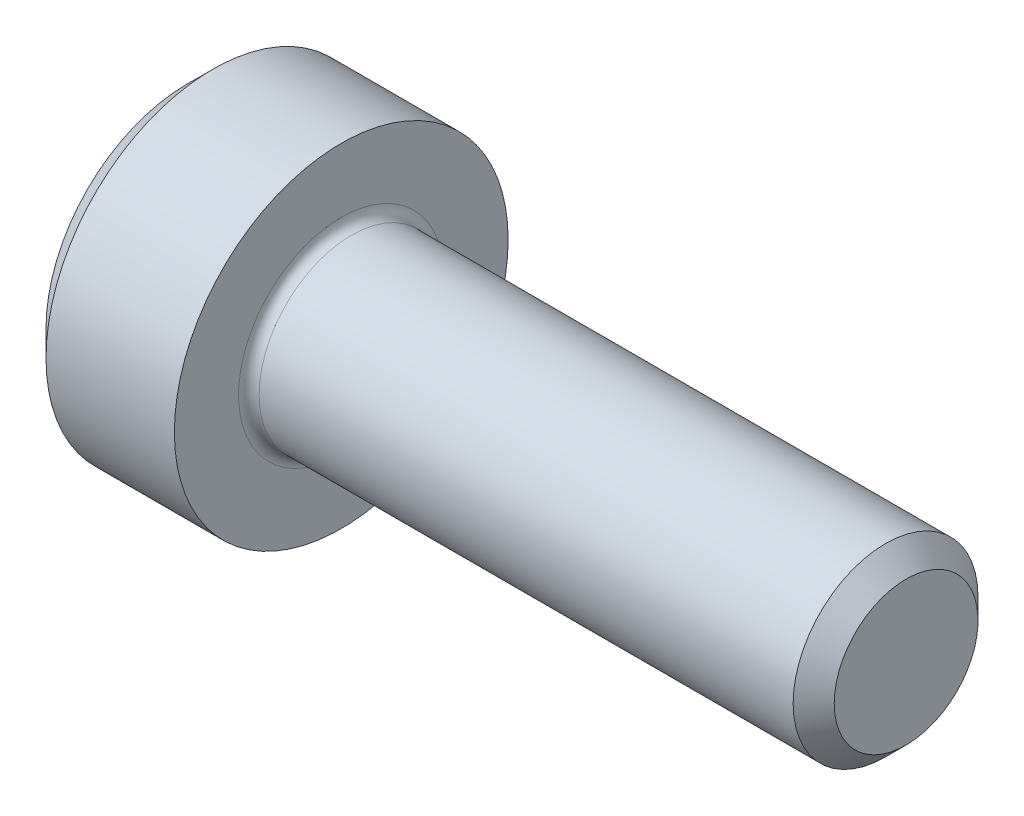
ISO-10303-21;
HEADER;
FILE_DESCRIPTION(('STEP AP214'),'2;1');
FILE_NAME('part.step','',(''),(''),'','','');
FILE_SCHEMA(('AUTOMOTIVE_DESIGN { 1 0 10303 214 1 1 1 1 }'));
ENDSEC;
DATA;
#1=APPLICATION_CONTEXT('core data for automotive mechanical design processes');
#2=APPLICATION_PROTOCOL_DEFINITION('international standard','automotive_design',2000,#1);
#3=PRODUCT_CONTEXT('',#1,'mechanical');
#4=PRODUCT('Part','Part','',(#3));
#5=PRODUCT_RELATED_PRODUCT_CATEGORY('part','',(#4));
#6=PRODUCT_DEFINITION_FORMATION('','',#4);
#7=PRODUCT_DEFINITION_CONTEXT('part definition',#1,'design');
#8=PRODUCT_DEFINITION('design','',#6,#7);
#9=PRODUCT_DEFINITION_SHAPE('','',#8);
#10=(LENGTH_UNIT() NAMED_UNIT(*) SI_UNIT(.MILLI.,.METRE.));
#11=(NAMED_UNIT(*) PLANE_ANGLE_UNIT() SI_UNIT($,.RADIAN.));
#12=(NAMED_UNIT(*) SI_UNIT($,.STERADIAN.) SOLID_ANGLE_UNIT());
#13=UNCERTAINTY_MEASURE_WITH_UNIT(LENGTH_MEASURE(1.E-05),#10,'distance_accuracy_value','');
#14=(GEOMETRIC_REPRESENTATION_CONTEXT(3) GLOBAL_UNCERTAINTY_ASSIGNED_CONTEXT((#13)) GLOBAL_UNIT_ASSIGNED_CONTEXT((#10,
#11,#12)) REPRESENTATION_CONTEXT('',''));
#15=CARTESIAN_POINT('',(0.,0.,0.));
#16=DIRECTION('',(0.,0.,1.));
#17=DIRECTION('',(1.,0.,0.));
#18=AXIS2_PLACEMENT_3D('',#15,#16,#17);
#19=CARTESIAN_POINT('',(0.,0.,0.));
#20=DIRECTION('',(-1.,0.,0.));
#21=DIRECTION('',(0.,0.,1.));
#22=AXIS2_PLACEMENT_3D('',#19,#20,#21);
#23=PLANE('',#22);
#24=DIRECTION('',(0.,-0.5,0.866025403784439));
#25=VECTOR('',#24,1.);
#26=CARTESIAN_POINT('',(0.,1.8475208614068,0.));
#27=LINE('',#26,#25);
#28=CARTESIAN_POINT('',(0.,1.8475208614068,0.));
#29=VERTEX_POINT('',#28);
#30=CARTESIAN_POINT('',(0.,0.9237604307034,1.6));
#31=VERTEX_POINT('',#30);
#32=EDGE_CURVE('E393',#29,#31,#27,.T.);
#33=ORIENTED_EDGE('',*,*,#32,.T.);
#34=DIRECTION('',(0.,1.,0.));
#35=VECTOR('',#34,1.);
#36=CARTESIAN_POINT('',(0.,-0.923760430703403,1.6));
#37=LINE('',#36,#35);
#38=CARTESIAN_POINT('',(0.,-0.923760430703403,1.6));
#39=VERTEX_POINT('',#38);
#40=EDGE_CURVE('E135',#39,#31,#37,.T.);
#41=ORIENTED_EDGE('',*,*,#40,.F.);
#42=DIRECTION('',(0.,-0.500000000000001,-0.866025403784438));
#43=VECTOR('',#42,1.);
#44=CARTESIAN_POINT('',(0.,-0.923760430703403,1.6));
#45=LINE('',#44,#43);
#46=CARTESIAN_POINT('',(0.,-1.84752086140681,0.));
#47=VERTEX_POINT('',#46);
#48=EDGE_CURVE('E396',#39,#47,#45,.T.);
#49=ORIENTED_EDGE('',*,*,#48,.T.);
#50=DIRECTION('',(0.,0.5,-0.866025403784439));
#51=VECTOR('',#50,1.);
#52=CARTESIAN_POINT('',(0.,-1.84752086140681,0.));
#53=LINE('',#52,#51);
#54=CARTESIAN_POINT('',(0.,-0.923760430703406,-1.6));
#55=VERTEX_POINT('',#54);
#56=EDGE_CURVE('E399',#47,#55,#53,.T.);
#57=ORIENTED_EDGE('',*,*,#56,.T.);
#58=DIRECTION('',(0.,-1.,0.));
#59=VECTOR('',#58,1.);
#60=CARTESIAN_POINT('',(0.,0.923760430703397,-1.6));
#61=LINE('',#60,#59);
#62=CARTESIAN_POINT('',(0.,0.923760430703397,-1.6));
#63=VERTEX_POINT('',#62);
#64=EDGE_CURVE('E402',#63,#55,#61,.T.);
#65=ORIENTED_EDGE('',*,*,#64,.F.);
#66=DIRECTION('',(0.,-0.500000000000001,-0.866025403784438));
#67=VECTOR('',#66,1.);
#68=CARTESIAN_POINT('',(0.,1.8475208614068,0.));
#69=LINE('',#68,#67);
#70=EDGE_CURVE('E130',#29,#63,#69,.T.);
#71=ORIENTED_EDGE('',*,*,#70,.F.);
#72=EDGE_LOOP('',(#33,#41,#49,#57,#65,#71));
#73=FACE_BOUND('',#72,.T.);
#74=CARTESIAN_POINT('',(0.,0.,0.));
#75=DIRECTION('',(-1.,0.,0.));
#76=DIRECTION('',(0.,0.,1.));
#77=AXIS2_PLACEMENT_3D('',#74,#75,#76);
#78=CIRCLE('',#77,2.75);
#79=CARTESIAN_POINT('',(0.,0.,2.75));
#80=VERTEX_POINT('',#79);
#81=EDGE_CURVE('E146',#80,#80,#78,.T.);
#82=ORIENTED_EDGE('',*,*,#81,.T.);
#83=EDGE_LOOP('',(#82));
#84=FACE_BOUND('',#83,.T.);
#85=ADVANCED_FACE('F39',(#73,#84),#23,.T.);
#86=CARTESIAN_POINT('',(14.,1.4,0.));
#87=DIRECTION('',(1.,0.,0.));
#88=DIRECTION('',(0.,0.,-1.));
#89=AXIS2_PLACEMENT_3D('',#86,#87,#88);
#90=PLANE('',#89);
#91=CARTESIAN_POINT('',(14.,0.,0.));
#92=DIRECTION('',(-1.,0.,0.));
#93=DIRECTION('',(0.,0.,1.));
#94=AXIS2_PLACEMENT_3D('',#91,#92,#93);
#95=CIRCLE('',#94,1.4);
#96=CARTESIAN_POINT('',(14.,0.,1.4));
#97=VERTEX_POINT('',#96);
#98=EDGE_CURVE('E159',#97,#97,#95,.T.);
#99=ORIENTED_EDGE('',*,*,#98,.F.);
#100=EDGE_LOOP('',(#99));
#101=FACE_BOUND('',#100,.T.);
#102=ADVANCED_FACE('F180',(#101),#90,.T.);
#103=CARTESIAN_POINT('',(14.,0.,0.));
#104=DIRECTION('',(-1.,0.,0.));
#105=DIRECTION('',(0.,0.,1.));
#106=AXIS2_PLACEMENT_3D('',#103,#104,#105);
#107=CONICAL_SURFACE('',#106,1.4,0.785398163397417);
#108=CARTESIAN_POINT('',(13.6,0.,0.));
#109=DIRECTION('',(-1.,0.,0.));
#110=DIRECTION('',(0.,0.,1.));
#111=AXIS2_PLACEMENT_3D('',#108,#109,#110);
#112=CIRCLE('',#111,1.79999999999998);
#113=CARTESIAN_POINT('',(13.6,0.,1.79999999999998));
#114=VERTEX_POINT('',#113);
#115=EDGE_CURVE('E156',#114,#114,#112,.T.);
#116=ORIENTED_EDGE('',*,*,#115,.F.);
#117=EDGE_LOOP('',(#116));
#118=FACE_BOUND('',#117,.T.);
#119=ORIENTED_EDGE('',*,*,#98,.T.);
#120=EDGE_LOOP('',(#119));
#121=FACE_BOUND('',#120,.T.);
#122=ADVANCED_FACE('F186',(#118,#121),#107,.T.);
#123=CARTESIAN_POINT('',(-31.75,0.,0.));
#124=DIRECTION('',(-1.,0.,0.));
#125=DIRECTION('',(0.,0.,1.));
#126=AXIS2_PLACEMENT_3D('',#123,#124,#125);
#127=CYLINDRICAL_SURFACE('',#126,1.79999999999999);
#128=CARTESIAN_POINT('',(3.2,0.,0.));
#129=DIRECTION('',(1.,0.,0.));
#130=DIRECTION('',(0.,0.,-1.));
#131=AXIS2_PLACEMENT_3D('',#128,#129,#130);
#132=CIRCLE('',#131,1.79999999999999);
#133=CARTESIAN_POINT('',(3.2,0.,-1.79999999999999));
#134=VERTEX_POINT('',#133);
#135=EDGE_CURVE('E11',#134,#134,#132,.T.);
#136=ORIENTED_EDGE('',*,*,#135,.T.);
#137=EDGE_LOOP('',(#136));
#138=FACE_BOUND('',#137,.T.);
#139=ORIENTED_EDGE('',*,*,#115,.T.);
#140=EDGE_LOOP('',(#139));
#141=FACE_BOUND('',#140,.T.);
#142=ADVANCED_FACE('F197',(#138,#141),#127,.T.);
#143=CARTESIAN_POINT('',(3.,3.25,0.));
#144=DIRECTION('',(1.,0.,0.));
#145=DIRECTION('',(0.,0.,-1.));
#146=AXIS2_PLACEMENT_3D('',#143,#144,#145);
#147=PLANE('',#146);
#148=CARTESIAN_POINT('',(3.,0.,0.));
#149=DIRECTION('',(1.,0.,0.));
#150=DIRECTION('',(0.,0.,-1.));
#151=AXIS2_PLACEMENT_3D('',#148,#149,#150);
#152=CIRCLE('',#151,1.99999999999999);
#153=CARTESIAN_POINT('',(3.,0.,-1.99999999999999));
#154=VERTEX_POINT('',#153);
#155=EDGE_CURVE('E47',#154,#154,#152,.F.);
#156=ORIENTED_EDGE('',*,*,#155,.T.);
#157=EDGE_LOOP('',(#156));
#158=FACE_BOUND('',#157,.T.);
#159=CARTESIAN_POINT('',(3.,0.,0.));
#160=DIRECTION('',(-1.,0.,0.));
#161=DIRECTION('',(0.,0.,1.));
#162=AXIS2_PLACEMENT_3D('',#159,#160,#161);
#163=CIRCLE('',#162,3.25);
#164=CARTESIAN_POINT('',(3.,0.,3.25));
#165=VERTEX_POINT('',#164);
#166=EDGE_CURVE('E153',#165,#165,#163,.T.);
#167=ORIENTED_EDGE('',*,*,#166,.F.);
#168=EDGE_LOOP('',(#167));
#169=FACE_BOUND('',#168,.T.);
#170=ADVANCED_FACE('F164',(#158,#169),#147,.T.);
#171=CARTESIAN_POINT('',(-31.75,0.,0.));
#172=DIRECTION('',(-1.,0.,0.));
#173=DIRECTION('',(0.,0.,1.));
#174=AXIS2_PLACEMENT_3D('',#171,#172,#173);
#175=CYLINDRICAL_SURFACE('',#174,3.25);
#176=ORIENTED_EDGE('',*,*,#166,.T.);
#177=EDGE_LOOP('',(#176));
#178=FACE_BOUND('',#177,.T.);
#179=CARTESIAN_POINT('',(0.5,0.,0.));
#180=DIRECTION('',(-1.,0.,0.));
#181=DIRECTION('',(0.,0.,1.));
#182=AXIS2_PLACEMENT_3D('',#179,#180,#181);
#183=CIRCLE('',#182,3.25);
#184=CARTESIAN_POINT('',(0.5,0.,3.25));
#185=VERTEX_POINT('',#184);
#186=EDGE_CURVE('E150',#185,#185,#183,.T.);
#187=ORIENTED_EDGE('',*,*,#186,.F.);
#188=EDGE_LOOP('',(#187));
#189=FACE_BOUND('',#188,.T.);
#190=ADVANCED_FACE('F175',(#178,#189),#175,.T.);
#191=CARTESIAN_POINT('',(0.,0.,0.));
#192=DIRECTION('',(1.,0.,0.));
#193=DIRECTION('',(0.,0.,-1.));
#194=AXIS2_PLACEMENT_3D('',#191,#192,#193);
#195=CONICAL_SURFACE('',#194,2.75,0.785398163397448);
#196=ORIENTED_EDGE('',*,*,#186,.T.);
#197=EDGE_LOOP('',(#196));
#198=FACE_BOUND('',#197,.T.);
#199=ORIENTED_EDGE('',*,*,#81,.F.);
#200=EDGE_LOOP('',(#199));
#201=FACE_BOUND('',#200,.T.);
#202=ADVANCED_FACE('F168',(#198,#201),#195,.T.);
#203=CARTESIAN_POINT('',(3.2,0.,0.));
#204=DIRECTION('',(1.,0.,0.));
#205=DIRECTION('',(0.,0.,-1.));
#206=AXIS2_PLACEMENT_3D('',#203,#204,#205);
#207=TOROIDAL_SURFACE('',#206,1.99999999999999,0.2);
#208=ORIENTED_EDGE('',*,*,#135,.F.);
#209=EDGE_LOOP('',(#208));
#210=FACE_BOUND('',#209,.T.);
#211=ORIENTED_EDGE('',*,*,#155,.F.);
#212=EDGE_LOOP('',(#211));
#213=FACE_BOUND('',#212,.T.);
#214=ADVANCED_FACE('F41',(#210,#213),#207,.F.);
#215=CARTESIAN_POINT('',(2.5,1.8475208614068,0.));
#216=DIRECTION('',(0.,-0.866025403784439,-0.5));
#217=DIRECTION('',(0.,0.5,-0.866025403784439));
#218=AXIS2_PLACEMENT_3D('',#215,#216,#217);
#219=PLANE('',#218);
#220=ORIENTED_EDGE('',*,*,#32,.F.);
#221=DIRECTION('',(-1.,0.,0.));
#222=VECTOR('',#221,1.);
#223=CARTESIAN_POINT('',(2.5,1.8475208614068,0.));
#224=LINE('',#223,#222);
#225=CARTESIAN_POINT('',(2.5,1.8475208614068,0.));
#226=VERTEX_POINT('',#225);
#227=EDGE_CURVE('E383',#226,#29,#224,.T.);
#228=ORIENTED_EDGE('',*,*,#227,.F.);
#229=DIRECTION('',(0.,-0.5,0.866025403784439));
#230=VECTOR('',#229,1.);
#231=CARTESIAN_POINT('',(2.5,1.8475208614068,0.));
#232=LINE('',#231,#230);
#233=CARTESIAN_POINT('',(2.5,1.3856406460551,0.799999999999998));
#234=VERTEX_POINT('',#233);
#235=EDGE_CURVE('E122',#226,#234,#232,.T.);
#236=ORIENTED_EDGE('',*,*,#235,.T.);
#237=CARTESIAN_POINT('',(2.5,0.9237604307034,1.6));
#238=VERTEX_POINT('',#237);
#239=EDGE_CURVE('E113',#234,#238,#232,.T.);
#240=ORIENTED_EDGE('',*,*,#239,.T.);
#241=DIRECTION('',(-1.,0.,0.));
#242=VECTOR('',#241,1.);
#243=CARTESIAN_POINT('',(2.5,0.9237604307034,1.6));
#244=LINE('',#243,#242);
#245=EDGE_CURVE('E127',#238,#31,#244,.T.);
#246=ORIENTED_EDGE('',*,*,#245,.T.);
#247=EDGE_LOOP('',(#220,#228,#236,#240,#246));
#248=FACE_BOUND('',#247,.T.);
#249=ADVANCED_FACE('F126',(#248),#219,.T.);
#250=CARTESIAN_POINT('',(2.5,-0.923760430703403,1.6));
#251=DIRECTION('',(0.,0.,1.));
#252=DIRECTION('',(0.,-1.,0.));
#253=AXIS2_PLACEMENT_3D('',#250,#251,#252);
#254=PLANE('',#253);
#255=ORIENTED_EDGE('',*,*,#40,.T.);
#256=ORIENTED_EDGE('',*,*,#245,.F.);
#257=DIRECTION('',(0.,1.,0.));
#258=VECTOR('',#257,1.);
#259=CARTESIAN_POINT('',(2.5,-0.923760430703403,1.6));
#260=LINE('',#259,#258);
#261=CARTESIAN_POINT('',(2.5,0.,1.6));
#262=VERTEX_POINT('',#261);
#263=EDGE_CURVE('E110',#262,#238,#260,.T.);
#264=ORIENTED_EDGE('',*,*,#263,.F.);
#265=CARTESIAN_POINT('',(2.5,-0.923760430703403,1.6));
#266=VERTEX_POINT('',#265);
#267=EDGE_CURVE('E121',#266,#262,#260,.T.);
#268=ORIENTED_EDGE('',*,*,#267,.F.);
#269=DIRECTION('',(-1.,0.,0.));
#270=VECTOR('',#269,1.);
#271=CARTESIAN_POINT('',(2.5,-0.923760430703403,1.6));
#272=LINE('',#271,#270);
#273=EDGE_CURVE('E137',#266,#39,#272,.T.);
#274=ORIENTED_EDGE('',*,*,#273,.T.);
#275=EDGE_LOOP('',(#255,#256,#264,#268,#274));
#276=FACE_BOUND('',#275,.T.);
#277=ADVANCED_FACE('F132',(#276),#254,.F.);
#278=CARTESIAN_POINT('',(2.5,-0.923760430703403,1.6));
#279=DIRECTION('',(0.,0.866025403784438,-0.500000000000001));
#280=DIRECTION('',(0.,0.500000000000001,0.866025403784438));
#281=AXIS2_PLACEMENT_3D('',#278,#279,#280);
#282=PLANE('',#281);
#283=ORIENTED_EDGE('',*,*,#48,.F.);
#284=ORIENTED_EDGE('',*,*,#273,.F.);
#285=DIRECTION('',(0.,-0.500000000000001,-0.866025403784438));
#286=VECTOR('',#285,1.);
#287=CARTESIAN_POINT('',(2.5,-0.923760430703403,1.6));
#288=LINE('',#287,#286);
#289=CARTESIAN_POINT('',(2.5,-1.3856406460551,0.800000000000003));
#290=VERTEX_POINT('',#289);
#291=EDGE_CURVE('E422',#266,#290,#288,.T.);
#292=ORIENTED_EDGE('',*,*,#291,.T.);
#293=CARTESIAN_POINT('',(2.5,-1.84752086140681,0.));
#294=VERTEX_POINT('',#293);
#295=EDGE_CURVE('E411',#290,#294,#288,.T.);
#296=ORIENTED_EDGE('',*,*,#295,.T.);
#297=DIRECTION('',(-1.,0.,0.));
#298=VECTOR('',#297,1.);
#299=CARTESIAN_POINT('',(2.5,-1.84752086140681,0.));
#300=LINE('',#299,#298);
#301=EDGE_CURVE('E142',#294,#47,#300,.T.);
#302=ORIENTED_EDGE('',*,*,#301,.T.);
#303=EDGE_LOOP('',(#283,#284,#292,#296,#302));
#304=FACE_BOUND('',#303,.T.);
#305=ADVANCED_FACE('F274',(#304),#282,.T.);
#306=CARTESIAN_POINT('',(2.5,-1.84752086140681,0.));
#307=DIRECTION('',(0.,0.866025403784439,0.5));
#308=DIRECTION('',(0.,-0.5,0.866025403784439));
#309=AXIS2_PLACEMENT_3D('',#306,#307,#308);
#310=PLANE('',#309);
#311=ORIENTED_EDGE('',*,*,#56,.F.);
#312=ORIENTED_EDGE('',*,*,#301,.F.);
#313=DIRECTION('',(0.,0.5,-0.866025403784439));
#314=VECTOR('',#313,1.);
#315=CARTESIAN_POINT('',(2.5,-1.84752086140681,0.));
#316=LINE('',#315,#314);
#317=CARTESIAN_POINT('',(2.5,-1.38564064605511,-0.800000000000001));
#318=VERTEX_POINT('',#317);
#319=EDGE_CURVE('E389',#294,#318,#316,.T.);
#320=ORIENTED_EDGE('',*,*,#319,.T.);
#321=CARTESIAN_POINT('',(2.5,-0.923760430703406,-1.6));
#322=VERTEX_POINT('',#321);
#323=EDGE_CURVE('E421',#318,#322,#316,.T.);
#324=ORIENTED_EDGE('',*,*,#323,.T.);
#325=DIRECTION('',(-1.,0.,0.));
#326=VECTOR('',#325,1.);
#327=CARTESIAN_POINT('',(2.5,-0.923760430703406,-1.6));
#328=LINE('',#327,#326);
#329=EDGE_CURVE('E382',#322,#55,#328,.T.);
#330=ORIENTED_EDGE('',*,*,#329,.T.);
#331=EDGE_LOOP('',(#311,#312,#320,#324,#330));
#332=FACE_BOUND('',#331,.T.);
#333=ADVANCED_FACE('F282',(#332),#310,.T.);
#334=CARTESIAN_POINT('',(2.5,0.923760430703397,-1.6));
#335=DIRECTION('',(0.,0.,-1.));
#336=DIRECTION('',(0.,1.,0.));
#337=AXIS2_PLACEMENT_3D('',#334,#335,#336);
#338=PLANE('',#337);
#339=ORIENTED_EDGE('',*,*,#64,.T.);
#340=ORIENTED_EDGE('',*,*,#329,.F.);
#341=DIRECTION('',(0.,-1.,0.));
#342=VECTOR('',#341,1.);
#343=CARTESIAN_POINT('',(2.5,0.923760430703397,-1.6));
#344=LINE('',#343,#342);
#345=CARTESIAN_POINT('',(2.5,0.,-1.6));
#346=VERTEX_POINT('',#345);
#347=EDGE_CURVE('E386',#346,#322,#344,.T.);
#348=ORIENTED_EDGE('',*,*,#347,.F.);
#349=CARTESIAN_POINT('',(2.5,0.923760430703397,-1.6));
#350=VERTEX_POINT('',#349);
#351=EDGE_CURVE('E54',#350,#346,#344,.T.);
#352=ORIENTED_EDGE('',*,*,#351,.F.);
#353=DIRECTION('',(-1.,0.,0.));
#354=VECTOR('',#353,1.);
#355=CARTESIAN_POINT('',(2.5,0.923760430703397,-1.6));
#356=LINE('',#355,#354);
#357=EDGE_CURVE('E379',#350,#63,#356,.T.);
#358=ORIENTED_EDGE('',*,*,#357,.T.);
#359=EDGE_LOOP('',(#339,#340,#348,#352,#358));
#360=FACE_BOUND('',#359,.T.);
#361=ADVANCED_FACE('F291',(#360),#338,.F.);
#362=CARTESIAN_POINT('',(2.5,1.8475208614068,0.));
#363=DIRECTION('',(0.,0.866025403784438,-0.500000000000001));
#364=DIRECTION('',(0.,0.500000000000001,0.866025403784438));
#365=AXIS2_PLACEMENT_3D('',#362,#363,#364);
#366=PLANE('',#365);
#367=ORIENTED_EDGE('',*,*,#70,.T.);
#368=ORIENTED_EDGE('',*,*,#357,.F.);
#369=DIRECTION('',(0.,-0.500000000000001,-0.866025403784438));
#370=VECTOR('',#369,1.);
#371=CARTESIAN_POINT('',(2.5,1.8475208614068,0.));
#372=LINE('',#371,#370);
#373=CARTESIAN_POINT('',(2.5,1.3856406460551,-0.800000000000001));
#374=VERTEX_POINT('',#373);
#375=EDGE_CURVE('E369',#374,#350,#372,.T.);
#376=ORIENTED_EDGE('',*,*,#375,.F.);
#377=EDGE_CURVE('E375',#226,#374,#372,.T.);
#378=ORIENTED_EDGE('',*,*,#377,.F.);
#379=ORIENTED_EDGE('',*,*,#227,.T.);
#380=EDGE_LOOP('',(#367,#368,#376,#378,#379));
#381=FACE_BOUND('',#380,.T.);
#382=ADVANCED_FACE('F300',(#381),#366,.F.);
#383=CARTESIAN_POINT('',(2.5,1.8475208614068,0.));
#384=DIRECTION('',(1.,0.,0.));
#385=DIRECTION('',(0.,0.,-1.));
#386=AXIS2_PLACEMENT_3D('',#383,#384,#385);
#387=PLANE('',#386);
#388=ORIENTED_EDGE('',*,*,#347,.T.);
#389=ORIENTED_EDGE('',*,*,#323,.F.);
#390=CARTESIAN_POINT('',(2.5,0.,0.));
#391=DIRECTION('',(-1.,0.,0.));
#392=DIRECTION('',(0.,0.,1.));
#393=AXIS2_PLACEMENT_3D('',#390,#391,#392);
#394=CIRCLE('',#393,1.6);
#395=EDGE_CURVE('E417',#346,#318,#394,.T.);
#396=ORIENTED_EDGE('',*,*,#395,.F.);
#397=EDGE_LOOP('',(#388,#389,#396));
#398=FACE_BOUND('',#397,.T.);
#399=ADVANCED_FACE('F309',(#398),#387,.F.);
#400=ORIENTED_EDGE('',*,*,#319,.F.);
#401=ORIENTED_EDGE('',*,*,#295,.F.);
#402=EDGE_CURVE('E140',#318,#290,#394,.T.);
#403=ORIENTED_EDGE('',*,*,#402,.F.);
#404=EDGE_LOOP('',(#400,#401,#403));
#405=FACE_BOUND('',#404,.T.);
#406=ADVANCED_FACE('F318',(#405),#387,.F.);
#407=ORIENTED_EDGE('',*,*,#291,.F.);
#408=ORIENTED_EDGE('',*,*,#267,.T.);
#409=EDGE_CURVE('E136',#290,#262,#394,.T.);
#410=ORIENTED_EDGE('',*,*,#409,.F.);
#411=EDGE_LOOP('',(#407,#408,#410));
#412=FACE_BOUND('',#411,.T.);
#413=ADVANCED_FACE('F327',(#412),#387,.F.);
#414=ORIENTED_EDGE('',*,*,#263,.T.);
#415=ORIENTED_EDGE('',*,*,#239,.F.);
#416=EDGE_CURVE('E116',#262,#234,#394,.T.);
#417=ORIENTED_EDGE('',*,*,#416,.F.);
#418=EDGE_LOOP('',(#414,#415,#417));
#419=FACE_BOUND('',#418,.T.);
#420=ADVANCED_FACE('F112',(#419),#387,.F.);
#421=ORIENTED_EDGE('',*,*,#235,.F.);
#422=ORIENTED_EDGE('',*,*,#377,.T.);
#423=EDGE_CURVE('E147',#234,#374,#394,.T.);
#424=ORIENTED_EDGE('',*,*,#423,.F.);
#425=EDGE_LOOP('',(#421,#422,#424));
#426=FACE_BOUND('',#425,.T.);
#427=ADVANCED_FACE('F342',(#426),#387,.F.);
#428=ORIENTED_EDGE('',*,*,#375,.T.);
#429=ORIENTED_EDGE('',*,*,#351,.T.);
#430=EDGE_CURVE('E372',#374,#346,#394,.T.);
#431=ORIENTED_EDGE('',*,*,#430,.F.);
#432=EDGE_LOOP('',(#428,#429,#431));
#433=FACE_BOUND('',#432,.T.);
#434=ADVANCED_FACE('F257',(#433),#387,.F.);
#435=CARTESIAN_POINT('',(2.5,0.,0.));
#436=DIRECTION('',(-1.,0.,0.));
#437=DIRECTION('',(0.,0.,1.));
#438=AXIS2_PLACEMENT_3D('',#435,#436,#437);
#439=CONICAL_SURFACE('',#438,1.6,1.04719755119659);
#440=CARTESIAN_POINT('',(3.42376043070342,0.,0.));
#441=VERTEX_POINT('',#440);
#442=VERTEX_LOOP('',#441);
#443=FACE_BOUND('',#442,.T.);
#444=ORIENTED_EDGE('',*,*,#416,.T.);
#445=ORIENTED_EDGE('',*,*,#423,.T.);
#446=ORIENTED_EDGE('',*,*,#430,.T.);
#447=ORIENTED_EDGE('',*,*,#395,.T.);
#448=ORIENTED_EDGE('',*,*,#402,.T.);
#449=ORIENTED_EDGE('',*,*,#409,.T.);
#450=EDGE_LOOP('',(#444,#445,#446,#447,#448,#449));
#451=FACE_BOUND('',#450,.T.);
#452=ADVANCED_FACE('F190',(#443,#451),#439,.F.);
#453=CLOSED_SHELL('',(#85,#102,#122,#142,#170,#190,#202,#214,#249,#277,#305,#333,#361,#382,#399,
#406,#413,#420,#427,#434,#452));
#454=MANIFOLD_SOLID_BREP('B2',#453);
#455=ADVANCED_BREP_SHAPE_REPRESENTATION('',(#18,#454),#14);
#456=SHAPE_DEFINITION_REPRESENTATION(#9,#455);
ENDSEC;
END-ISO-10303-21;
